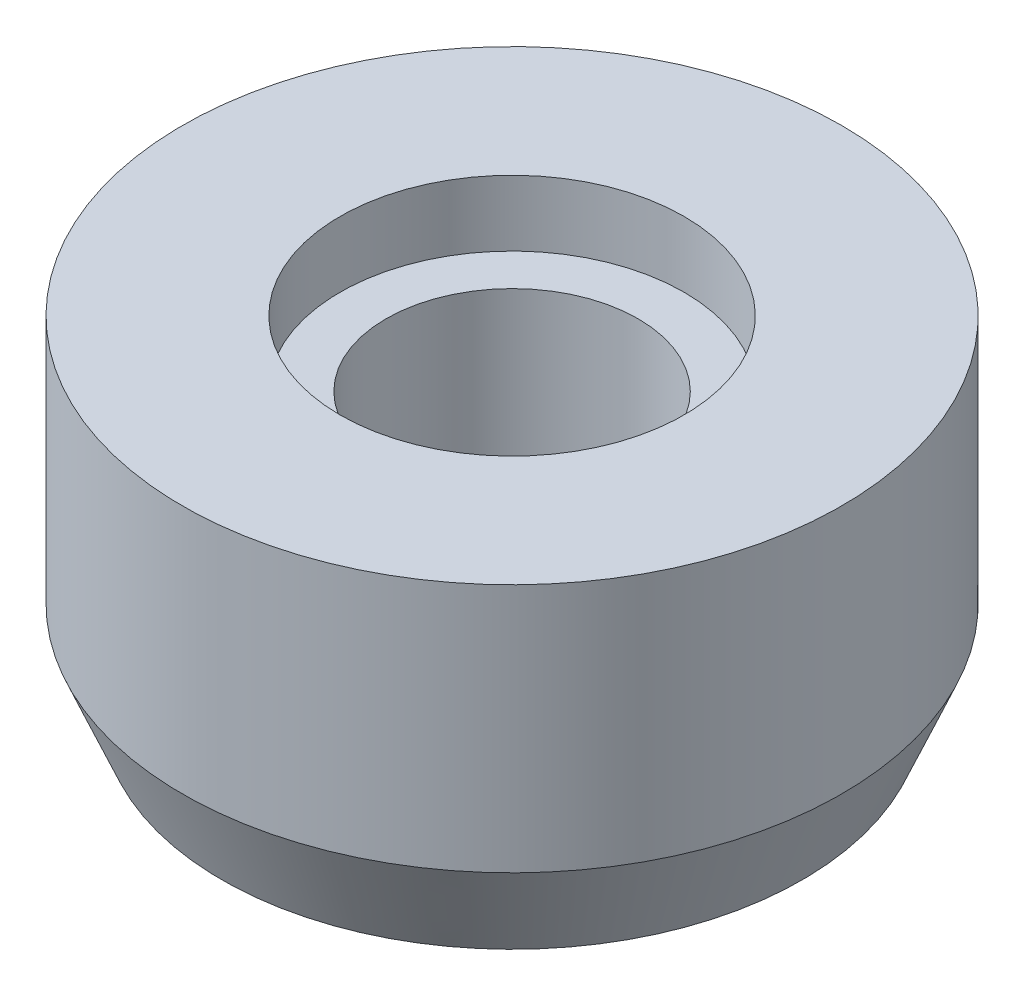
ISO-10303-21;
HEADER;
FILE_DESCRIPTION(('STEP AP214'),'2;1');
FILE_NAME('part.step','',(''),(''),'','','');
FILE_SCHEMA(('AUTOMOTIVE_DESIGN { 1 0 10303 214 1 1 1 1 }'));
ENDSEC;
DATA;
#1=APPLICATION_CONTEXT('core data for automotive mechanical design processes');
#2=APPLICATION_PROTOCOL_DEFINITION('international standard','automotive_design',2000,#1);
#3=PRODUCT_CONTEXT('',#1,'mechanical');
#4=PRODUCT('Part','Part','',(#3));
#5=PRODUCT_RELATED_PRODUCT_CATEGORY('part','',(#4));
#6=PRODUCT_DEFINITION_FORMATION('','',#4);
#7=PRODUCT_DEFINITION_CONTEXT('part definition',#1,'design');
#8=PRODUCT_DEFINITION('design','',#6,#7);
#9=PRODUCT_DEFINITION_SHAPE('','',#8);
#10=(LENGTH_UNIT() NAMED_UNIT(*) SI_UNIT(.MILLI.,.METRE.));
#11=(NAMED_UNIT(*) PLANE_ANGLE_UNIT() SI_UNIT($,.RADIAN.));
#12=(NAMED_UNIT(*) SI_UNIT($,.STERADIAN.) SOLID_ANGLE_UNIT());
#13=UNCERTAINTY_MEASURE_WITH_UNIT(LENGTH_MEASURE(1.E-05),#10,'distance_accuracy_value','');
#14=(GEOMETRIC_REPRESENTATION_CONTEXT(3) GLOBAL_UNCERTAINTY_ASSIGNED_CONTEXT((#13)) GLOBAL_UNIT_ASSIGNED_CONTEXT((#10,
#11,#12)) REPRESENTATION_CONTEXT('',''));
#15=CARTESIAN_POINT('',(0.,0.,0.));
#16=DIRECTION('',(0.,0.,1.));
#17=DIRECTION('',(1.,0.,0.));
#18=AXIS2_PLACEMENT_3D('',#15,#16,#17);
#19=CARTESIAN_POINT('',(0.,0.,0.));
#20=DIRECTION('',(0.,-1.,0.));
#21=DIRECTION('',(0.,0.,-1.));
#22=AXIS2_PLACEMENT_3D('',#19,#20,#21);
#23=CYLINDRICAL_SURFACE('',#22,4.8);
#24=CARTESIAN_POINT('',(0.,0.,0.));
#25=DIRECTION('',(0.,-1.,0.));
#26=DIRECTION('',(0.,0.,-1.));
#27=AXIS2_PLACEMENT_3D('',#24,#25,#26);
#28=CIRCLE('',#27,4.8);
#29=CARTESIAN_POINT('',(0.,0.,-4.8));
#30=VERTEX_POINT('',#29);
#31=EDGE_CURVE('E10',#30,#30,#28,.T.);
#32=ORIENTED_EDGE('',*,*,#31,.T.);
#33=EDGE_LOOP('',(#32));
#34=FACE_BOUND('',#33,.T.);
#35=CARTESIAN_POINT('',(0.,10.5826086956522,0.));
#36=DIRECTION('',(0.,-1.,0.));
#37=DIRECTION('',(0.,0.,-1.));
#38=AXIS2_PLACEMENT_3D('',#35,#36,#37);
#39=CIRCLE('',#38,4.8);
#40=CARTESIAN_POINT('',(0.,10.5826086956522,-4.8));
#41=VERTEX_POINT('',#40);
#42=EDGE_CURVE('E70',#41,#41,#39,.T.);
#43=ORIENTED_EDGE('',*,*,#42,.F.);
#44=EDGE_LOOP('',(#43));
#45=FACE_BOUND('',#44,.T.);
#46=ADVANCED_FACE('F39',(#34,#45),#23,.F.);
#47=CARTESIAN_POINT('',(4.8,0.,0.));
#48=DIRECTION('',(0.,-1.,0.));
#49=DIRECTION('',(0.,0.,-1.));
#50=AXIS2_PLACEMENT_3D('',#47,#48,#49);
#51=PLANE('',#50);
#52=CARTESIAN_POINT('',(0.,0.,0.));
#53=DIRECTION('',(0.,-1.,0.));
#54=DIRECTION('',(0.,0.,-1.));
#55=AXIS2_PLACEMENT_3D('',#52,#53,#54);
#56=CIRCLE('',#55,11.05);
#57=CARTESIAN_POINT('',(0.,0.,-11.05));
#58=VERTEX_POINT('',#57);
#59=EDGE_CURVE('E46',#58,#58,#56,.T.);
#60=ORIENTED_EDGE('',*,*,#59,.T.);
#61=EDGE_LOOP('',(#60));
#62=FACE_BOUND('',#61,.T.);
#63=ORIENTED_EDGE('',*,*,#31,.F.);
#64=EDGE_LOOP('',(#63));
#65=FACE_BOUND('',#64,.T.);
#66=ADVANCED_FACE('F79',(#62,#65),#51,.T.);
#67=CARTESIAN_POINT('',(0.,0.,0.));
#68=DIRECTION('',(0.,1.,0.));
#69=DIRECTION('',(0.,0.,1.));
#70=AXIS2_PLACEMENT_3D('',#67,#68,#69);
#71=CONICAL_SURFACE('',#70,11.05,0.396513325867565);
#72=CARTESIAN_POINT('',(0.,3.58260869565218,0.));
#73=DIRECTION('',(0.,-1.,0.));
#74=DIRECTION('',(0.,0.,-1.));
#75=AXIS2_PLACEMENT_3D('',#72,#73,#74);
#76=CIRCLE('',#75,12.55);
#77=CARTESIAN_POINT('',(0.,3.58260869565218,-12.55));
#78=VERTEX_POINT('',#77);
#79=EDGE_CURVE('E51',#78,#78,#76,.T.);
#80=ORIENTED_EDGE('',*,*,#79,.T.);
#81=EDGE_LOOP('',(#80));
#82=FACE_BOUND('',#81,.T.);
#83=ORIENTED_EDGE('',*,*,#59,.F.);
#84=EDGE_LOOP('',(#83));
#85=FACE_BOUND('',#84,.T.);
#86=ADVANCED_FACE('F83',(#82,#85),#71,.T.);
#87=CARTESIAN_POINT('',(0.,0.,0.));
#88=DIRECTION('',(0.,-1.,0.));
#89=DIRECTION('',(0.,0.,-1.));
#90=AXIS2_PLACEMENT_3D('',#87,#88,#89);
#91=CYLINDRICAL_SURFACE('',#90,12.55);
#92=CARTESIAN_POINT('',(0.,13.0826086956522,0.));
#93=DIRECTION('',(0.,-1.,0.));
#94=DIRECTION('',(0.,0.,-1.));
#95=AXIS2_PLACEMENT_3D('',#92,#93,#94);
#96=CIRCLE('',#95,12.55);
#97=CARTESIAN_POINT('',(0.,13.0826086956522,-12.55));
#98=VERTEX_POINT('',#97);
#99=EDGE_CURVE('E56',#98,#98,#96,.T.);
#100=ORIENTED_EDGE('',*,*,#99,.T.);
#101=EDGE_LOOP('',(#100));
#102=FACE_BOUND('',#101,.T.);
#103=ORIENTED_EDGE('',*,*,#79,.F.);
#104=EDGE_LOOP('',(#103));
#105=FACE_BOUND('',#104,.T.);
#106=ADVANCED_FACE('F87',(#102,#105),#91,.T.);
#107=CARTESIAN_POINT('',(12.55,13.0826086956522,0.));
#108=DIRECTION('',(0.,1.,0.));
#109=DIRECTION('',(0.,0.,1.));
#110=AXIS2_PLACEMENT_3D('',#107,#108,#109);
#111=PLANE('',#110);
#112=CARTESIAN_POINT('',(0.,13.0826086956522,0.));
#113=DIRECTION('',(0.,-1.,0.));
#114=DIRECTION('',(0.,0.,-1.));
#115=AXIS2_PLACEMENT_3D('',#112,#113,#114);
#116=CIRCLE('',#115,6.55);
#117=CARTESIAN_POINT('',(0.,13.0826086956522,-6.55));
#118=VERTEX_POINT('',#117);
#119=EDGE_CURVE('E62',#118,#118,#116,.T.);
#120=ORIENTED_EDGE('',*,*,#119,.T.);
#121=EDGE_LOOP('',(#120));
#122=FACE_BOUND('',#121,.T.);
#123=ORIENTED_EDGE('',*,*,#99,.F.);
#124=EDGE_LOOP('',(#123));
#125=FACE_BOUND('',#124,.T.);
#126=ADVANCED_FACE('F94',(#122,#125),#111,.T.);
#127=CARTESIAN_POINT('',(0.,0.,0.));
#128=DIRECTION('',(0.,-1.,0.));
#129=DIRECTION('',(0.,0.,-1.));
#130=AXIS2_PLACEMENT_3D('',#127,#128,#129);
#131=CYLINDRICAL_SURFACE('',#130,6.55);
#132=CARTESIAN_POINT('',(0.,10.5826086956522,0.));
#133=DIRECTION('',(0.,-1.,0.));
#134=DIRECTION('',(0.,0.,-1.));
#135=AXIS2_PLACEMENT_3D('',#132,#133,#134);
#136=CIRCLE('',#135,6.55);
#137=CARTESIAN_POINT('',(0.,10.5826086956522,-6.55));
#138=VERTEX_POINT('',#137);
#139=EDGE_CURVE('E66',#138,#138,#136,.T.);
#140=ORIENTED_EDGE('',*,*,#139,.T.);
#141=EDGE_LOOP('',(#140));
#142=FACE_BOUND('',#141,.T.);
#143=ORIENTED_EDGE('',*,*,#119,.F.);
#144=EDGE_LOOP('',(#143));
#145=FACE_BOUND('',#144,.T.);
#146=ADVANCED_FACE('F98',(#142,#145),#131,.F.);
#147=CARTESIAN_POINT('',(6.55,10.5826086956522,0.));
#148=DIRECTION('',(0.,1.,0.));
#149=DIRECTION('',(0.,0.,1.));
#150=AXIS2_PLACEMENT_3D('',#147,#148,#149);
#151=PLANE('',#150);
#152=ORIENTED_EDGE('',*,*,#42,.T.);
#153=EDGE_LOOP('',(#152));
#154=FACE_BOUND('',#153,.T.);
#155=ORIENTED_EDGE('',*,*,#139,.F.);
#156=EDGE_LOOP('',(#155));
#157=FACE_BOUND('',#156,.T.);
#158=ADVANCED_FACE('F75',(#154,#157),#151,.T.);
#159=CLOSED_SHELL('',(#46,#66,#86,#106,#126,#146,#158));
#160=MANIFOLD_SOLID_BREP('B2',#159);
#161=ADVANCED_BREP_SHAPE_REPRESENTATION('',(#18,#160),#14);
#162=SHAPE_DEFINITION_REPRESENTATION(#9,#161);
ENDSEC;
END-ISO-10303-21;
